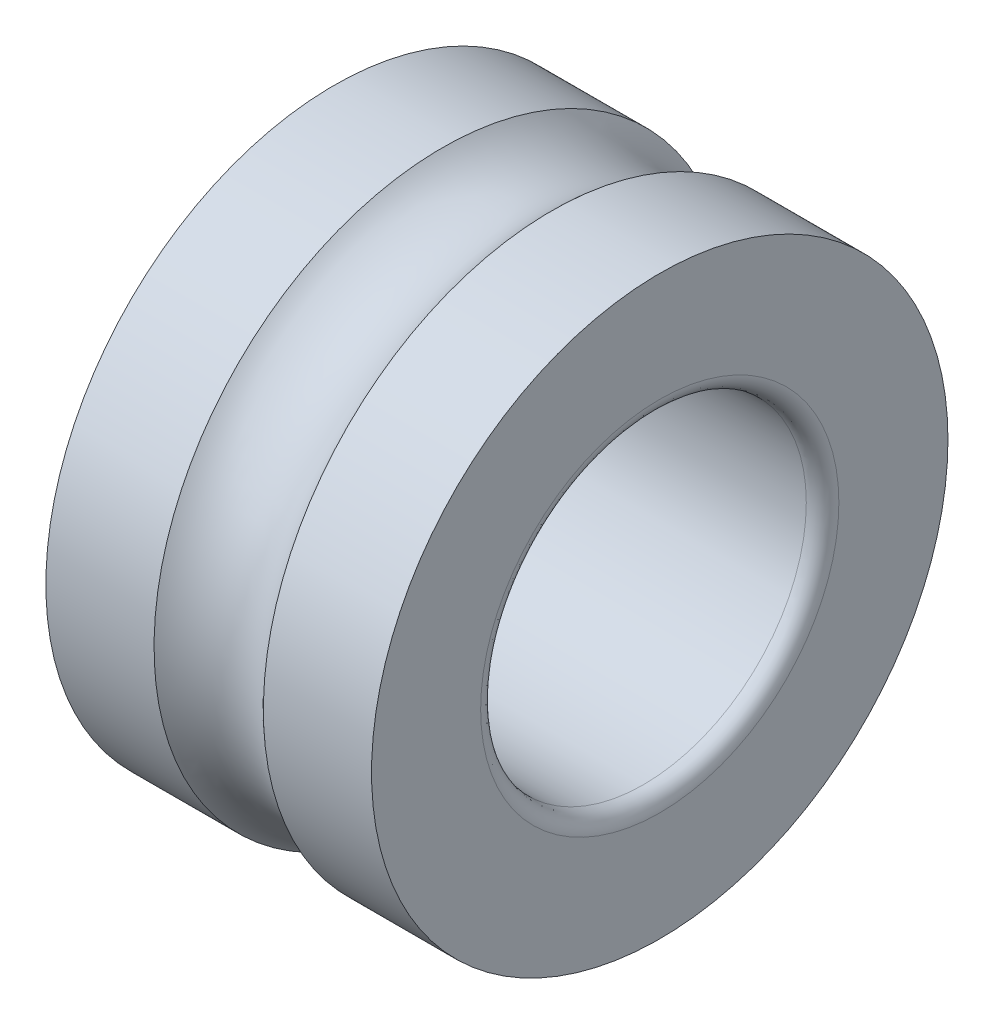
ISO-10303-21;
HEADER;
FILE_DESCRIPTION(('STEP AP214'),'2;1');
FILE_NAME('part.step','',(''),(''),'','','');
FILE_SCHEMA(('AUTOMOTIVE_DESIGN { 1 0 10303 214 1 1 1 1 }'));
ENDSEC;
DATA;
#1=APPLICATION_CONTEXT('core data for automotive mechanical design processes');
#2=APPLICATION_PROTOCOL_DEFINITION('international standard','automotive_design',2000,#1);
#3=PRODUCT_CONTEXT('',#1,'mechanical');
#4=PRODUCT('Part','Part','',(#3));
#5=PRODUCT_RELATED_PRODUCT_CATEGORY('part','',(#4));
#6=PRODUCT_DEFINITION_FORMATION('','',#4);
#7=PRODUCT_DEFINITION_CONTEXT('part definition',#1,'design');
#8=PRODUCT_DEFINITION('design','',#6,#7);
#9=PRODUCT_DEFINITION_SHAPE('','',#8);
#10=(LENGTH_UNIT() NAMED_UNIT(*) SI_UNIT(.MILLI.,.METRE.));
#11=(NAMED_UNIT(*) PLANE_ANGLE_UNIT() SI_UNIT($,.RADIAN.));
#12=(NAMED_UNIT(*) SI_UNIT($,.STERADIAN.) SOLID_ANGLE_UNIT());
#13=UNCERTAINTY_MEASURE_WITH_UNIT(LENGTH_MEASURE(1.E-05),#10,'distance_accuracy_value','');
#14=(GEOMETRIC_REPRESENTATION_CONTEXT(3) GLOBAL_UNCERTAINTY_ASSIGNED_CONTEXT((#13)) GLOBAL_UNIT_ASSIGNED_CONTEXT((#10,
#11,#12)) REPRESENTATION_CONTEXT('',''));
#15=CARTESIAN_POINT('',(0.,0.,0.));
#16=DIRECTION('',(0.,0.,1.));
#17=DIRECTION('',(1.,0.,0.));
#18=AXIS2_PLACEMENT_3D('',#15,#16,#17);
#19=CARTESIAN_POINT('',(0.839755569912476,0.,0.));
#20=DIRECTION('',(1.,0.,0.));
#21=DIRECTION('',(0.,0.,-1.));
#22=AXIS2_PLACEMENT_3D('',#19,#20,#21);
#23=CYLINDRICAL_SURFACE('',#22,4.4283249);
#24=CARTESIAN_POINT('',(2.5019,0.,0.));
#25=DIRECTION('',(1.,0.,0.));
#26=DIRECTION('',(0.,0.,-1.));
#27=AXIS2_PLACEMENT_3D('',#24,#25,#26);
#28=CIRCLE('',#27,4.4283249);
#29=CARTESIAN_POINT('',(2.5019,0.,-4.4283249));
#30=VERTEX_POINT('',#29);
#31=EDGE_CURVE('E54',#30,#30,#28,.F.);
#32=ORIENTED_EDGE('',*,*,#31,.T.);
#33=EDGE_LOOP('',(#32));
#34=FACE_BOUND('',#33,.T.);
#35=CARTESIAN_POINT('',(0.839755569912454,0.,0.));
#36=DIRECTION('',(1.,0.,0.));
#37=DIRECTION('',(0.,-1.,0.));
#38=AXIS2_PLACEMENT_3D('',#35,#36,#37);
#39=CIRCLE('',#38,4.42832490000002);
#40=CARTESIAN_POINT('',(0.839755569912454,-4.42832490000002,0.));
#41=VERTEX_POINT('',#40);
#42=EDGE_CURVE('E53',#41,#41,#39,.T.);
#43=ORIENTED_EDGE('',*,*,#42,.T.);
#44=EDGE_LOOP('',(#43));
#45=FACE_BOUND('',#44,.T.);
#46=ADVANCED_FACE('F17',(#34,#45),#23,.T.);
#47=CARTESIAN_POINT('',(2.5019,4.605457896,4.61007224199354));
#48=DIRECTION('',(1.,0.,0.));
#49=DIRECTION('',(0.,-1.,0.));
#50=AXIS2_PLACEMENT_3D('',#47,#48,#49);
#51=PLANE('',#50);
#52=CARTESIAN_POINT('',(2.50189999999999,0.,0.));
#53=DIRECTION('',(1.,0.,0.));
#54=DIRECTION('',(0.,-1.,0.));
#55=AXIS2_PLACEMENT_3D('',#52,#53,#54);
#56=CIRCLE('',#55,2.75209);
#57=CARTESIAN_POINT('',(2.50189999999999,2.75209,0.));
#58=VERTEX_POINT('',#57);
#59=CARTESIAN_POINT('',(2.50189999999999,-2.75209,0.));
#60=VERTEX_POINT('',#59);
#61=EDGE_CURVE('E51',#58,#60,#56,.F.);
#62=ORIENTED_EDGE('',*,*,#61,.T.);
#63=CARTESIAN_POINT('',(2.50189999999999,0.,0.));
#64=DIRECTION('',(1.,0.,0.));
#65=DIRECTION('',(0.,1.,0.));
#66=AXIS2_PLACEMENT_3D('',#63,#64,#65);
#67=CIRCLE('',#66,2.75209);
#68=EDGE_CURVE('E45',#60,#58,#67,.F.);
#69=ORIENTED_EDGE('',*,*,#68,.T.);
#70=EDGE_LOOP('',(#62,#69));
#71=FACE_BOUND('',#70,.T.);
#72=ORIENTED_EDGE('',*,*,#31,.F.);
#73=EDGE_LOOP('',(#72));
#74=FACE_BOUND('',#73,.T.);
#75=ADVANCED_FACE('F57',(#71,#74),#51,.T.);
#76=CARTESIAN_POINT('',(0.865514674075643,-4.4554545876962,0.));
#77=CARTESIAN_POINT('',(0.367700637430904,-3.91416333523807,0.));
#78=CARTESIAN_POINT('',(-0.367700637430802,-3.91416333523804,0.));
#79=CARTESIAN_POINT('',(-0.865514674075582,-4.45545458769613,0.));
#80=(BOUNDED_CURVE() B_SPLINE_CURVE(3,(#76,#77,#78,#79),.UNSPECIFIED.,.F.,
.F.) B_SPLINE_CURVE_WITH_KNOTS((4,4),(0.,1.),
.UNSPECIFIED.) CURVE() GEOMETRIC_REPRESENTATION_ITEM() RATIONAL_B_SPLINE_CURVE((1.,
0.784618958983424,0.784618958983424,1.)) REPRESENTATION_ITEM(''));
#81=CARTESIAN_POINT('',(0.,0.,0.));
#82=DIRECTION('',(1.,0.,0.));
#83=AXIS1_PLACEMENT('',#81,#82);
#84=SURFACE_OF_REVOLUTION('',#80,#83);
#85=ORIENTED_EDGE('',*,*,#42,.F.);
#86=EDGE_LOOP('',(#85));
#87=FACE_BOUND('',#86,.T.);
#88=CARTESIAN_POINT('',(-0.839755569912476,0.,0.));
#89=DIRECTION('',(1.,0.,0.));
#90=DIRECTION('',(0.,-1.,0.));
#91=AXIS2_PLACEMENT_3D('',#88,#89,#90);
#92=CIRCLE('',#91,4.4283249);
#93=CARTESIAN_POINT('',(-0.839755569912476,-4.4283249,0.));
#94=VERTEX_POINT('',#93);
#95=EDGE_CURVE('E59',#94,#94,#92,.T.);
#96=ORIENTED_EDGE('',*,*,#95,.T.);
#97=EDGE_LOOP('',(#96));
#98=FACE_BOUND('',#97,.T.);
#99=ADVANCED_FACE('F74',(#87,#98),#84,.F.);
#100=CARTESIAN_POINT('',(2.50035572797488,-2.779844964598,0.));
#101=CARTESIAN_POINT('',(2.51964043524467,-2.60708091509082,0.));
#102=CARTESIAN_POINT('',(2.39671908490918,-2.48415956475533,0.));
#103=CARTESIAN_POINT('',(2.223955035402,-2.50344427202512,0.));
#104=(BOUNDED_CURVE() B_SPLINE_CURVE(3,(#100,#101,#102,#103),.UNSPECIFIED.,.F.,
.F.) B_SPLINE_CURVE_WITH_KNOTS((4,4),(0.,1.),
.UNSPECIFIED.) CURVE() GEOMETRIC_REPRESENTATION_ITEM() RATIONAL_B_SPLINE_CURVE((1.,
0.749532639687892,0.749532639687892,1.)) REPRESENTATION_ITEM(''));
#105=CARTESIAN_POINT('',(2.25171,0.,0.));
#106=DIRECTION('',(1.,0.,0.));
#107=AXIS1_PLACEMENT('',#105,#106);
#108=SURFACE_OF_REVOLUTION('',#104,#107);
#109=ORIENTED_EDGE('',*,*,#61,.F.);
#110=ORIENTED_EDGE('',*,*,#68,.F.);
#111=EDGE_LOOP('',(#109,#110));
#112=FACE_BOUND('',#111,.T.);
#113=CARTESIAN_POINT('',(2.25171,0.,0.));
#114=DIRECTION('',(1.,0.,0.));
#115=DIRECTION('',(0.,-1.,0.));
#116=AXIS2_PLACEMENT_3D('',#113,#114,#115);
#117=CIRCLE('',#116,2.5019);
#118=CARTESIAN_POINT('',(2.25171,-2.5019,0.));
#119=VERTEX_POINT('',#118);
#120=EDGE_CURVE('E105',#119,#119,#117,.F.);
#121=ORIENTED_EDGE('',*,*,#120,.T.);
#122=EDGE_LOOP('',(#121));
#123=FACE_BOUND('',#122,.T.);
#124=ADVANCED_FACE('F49',(#112,#123),#108,.T.);
#125=CARTESIAN_POINT('',(-2.5019,0.,0.));
#126=DIRECTION('',(1.,0.,0.));
#127=DIRECTION('',(0.,0.,-1.));
#128=AXIS2_PLACEMENT_3D('',#125,#126,#127);
#129=CYLINDRICAL_SURFACE('',#128,4.4283249);
#130=ORIENTED_EDGE('',*,*,#95,.F.);
#131=EDGE_LOOP('',(#130));
#132=FACE_BOUND('',#131,.T.);
#133=CARTESIAN_POINT('',(-2.5019,0.,0.));
#134=DIRECTION('',(1.,0.,0.));
#135=DIRECTION('',(0.,0.,-1.));
#136=AXIS2_PLACEMENT_3D('',#133,#134,#135);
#137=CIRCLE('',#136,4.4283249);
#138=CARTESIAN_POINT('',(-2.5019,0.,-4.4283249));
#139=VERTEX_POINT('',#138);
#140=EDGE_CURVE('E97',#139,#139,#137,.T.);
#141=ORIENTED_EDGE('',*,*,#140,.T.);
#142=EDGE_LOOP('',(#141));
#143=FACE_BOUND('',#142,.T.);
#144=ADVANCED_FACE('F151',(#132,#143),#129,.T.);
#145=CARTESIAN_POINT('',(-2.25171,0.,0.));
#146=DIRECTION('',(1.,0.,0.));
#147=DIRECTION('',(0.,0.,-1.));
#148=AXIS2_PLACEMENT_3D('',#145,#146,#147);
#149=CYLINDRICAL_SURFACE('',#148,2.5019);
#150=ORIENTED_EDGE('',*,*,#120,.F.);
#151=EDGE_LOOP('',(#150));
#152=FACE_BOUND('',#151,.T.);
#153=CARTESIAN_POINT('',(-2.25171,0.,0.));
#154=DIRECTION('',(1.,0.,0.));
#155=DIRECTION('',(0.,-1.,0.));
#156=AXIS2_PLACEMENT_3D('',#153,#154,#155);
#157=CIRCLE('',#156,2.50190000000001);
#158=CARTESIAN_POINT('',(-2.25171,-2.50190000000001,0.));
#159=VERTEX_POINT('',#158);
#160=EDGE_CURVE('E30',#159,#159,#157,.F.);
#161=ORIENTED_EDGE('',*,*,#160,.T.);
#162=EDGE_LOOP('',(#161));
#163=FACE_BOUND('',#162,.T.);
#164=ADVANCED_FACE('F122',(#152,#163),#149,.F.);
#165=CARTESIAN_POINT('',(-2.5019,4.605457896,4.61007224199354));
#166=DIRECTION('',(1.,0.,0.));
#167=DIRECTION('',(0.,-1.,0.));
#168=AXIS2_PLACEMENT_3D('',#165,#166,#167);
#169=PLANE('',#168);
#170=CARTESIAN_POINT('',(-2.50189999999999,0.,0.));
#171=DIRECTION('',(-1.,0.,0.));
#172=DIRECTION('',(0.,-1.,0.));
#173=AXIS2_PLACEMENT_3D('',#170,#171,#172);
#174=CIRCLE('',#173,2.75209);
#175=CARTESIAN_POINT('',(-2.50189999999999,-2.75209,0.));
#176=VERTEX_POINT('',#175);
#177=CARTESIAN_POINT('',(-2.50189999999999,2.75209,0.));
#178=VERTEX_POINT('',#177);
#179=EDGE_CURVE('E36',#176,#178,#174,.T.);
#180=ORIENTED_EDGE('',*,*,#179,.F.);
#181=CARTESIAN_POINT('',(-2.50189999999999,0.,0.));
#182=DIRECTION('',(-1.,0.,0.));
#183=DIRECTION('',(0.,1.,0.));
#184=AXIS2_PLACEMENT_3D('',#181,#182,#183);
#185=CIRCLE('',#184,2.75209);
#186=EDGE_CURVE('E11',#176,#178,#185,.F.);
#187=ORIENTED_EDGE('',*,*,#186,.T.);
#188=EDGE_LOOP('',(#180,#187));
#189=FACE_BOUND('',#188,.T.);
#190=ORIENTED_EDGE('',*,*,#140,.F.);
#191=EDGE_LOOP('',(#190));
#192=FACE_BOUND('',#191,.T.);
#193=ADVANCED_FACE('F19',(#189,#192),#169,.F.);
#194=CARTESIAN_POINT('',(-2.223955035402,-2.50344427202512,0.));
#195=CARTESIAN_POINT('',(-2.39671908490918,-2.48415956475533,0.));
#196=CARTESIAN_POINT('',(-2.51964043524467,-2.60708091509082,0.));
#197=CARTESIAN_POINT('',(-2.50035572797488,-2.779844964598,0.));
#198=(BOUNDED_CURVE() B_SPLINE_CURVE(3,(#194,#195,#196,#197),.UNSPECIFIED.,.F.,
.F.) B_SPLINE_CURVE_WITH_KNOTS((4,4),(0.,1.),
.UNSPECIFIED.) CURVE() GEOMETRIC_REPRESENTATION_ITEM() RATIONAL_B_SPLINE_CURVE((1.,
0.749532639687892,0.749532639687892,1.)) REPRESENTATION_ITEM(''));
#199=CARTESIAN_POINT('',(-2.25171,0.,0.));
#200=DIRECTION('',(1.,0.,0.));
#201=AXIS1_PLACEMENT('',#199,#200);
#202=SURFACE_OF_REVOLUTION('',#198,#201);
#203=ORIENTED_EDGE('',*,*,#179,.T.);
#204=ORIENTED_EDGE('',*,*,#186,.F.);
#205=EDGE_LOOP('',(#203,#204));
#206=FACE_BOUND('',#205,.T.);
#207=ORIENTED_EDGE('',*,*,#160,.F.);
#208=EDGE_LOOP('',(#207));
#209=FACE_BOUND('',#208,.T.);
#210=ADVANCED_FACE('F112',(#206,#209),#202,.T.);
#211=CLOSED_SHELL('',(#46,#75,#99,#124,#144,#164,#193,#210));
#212=MANIFOLD_SOLID_BREP('B1',#211);
#213=ADVANCED_BREP_SHAPE_REPRESENTATION('',(#18,#212),#14);
#214=SHAPE_DEFINITION_REPRESENTATION(#9,#213);
ENDSEC;
END-ISO-10303-21;
